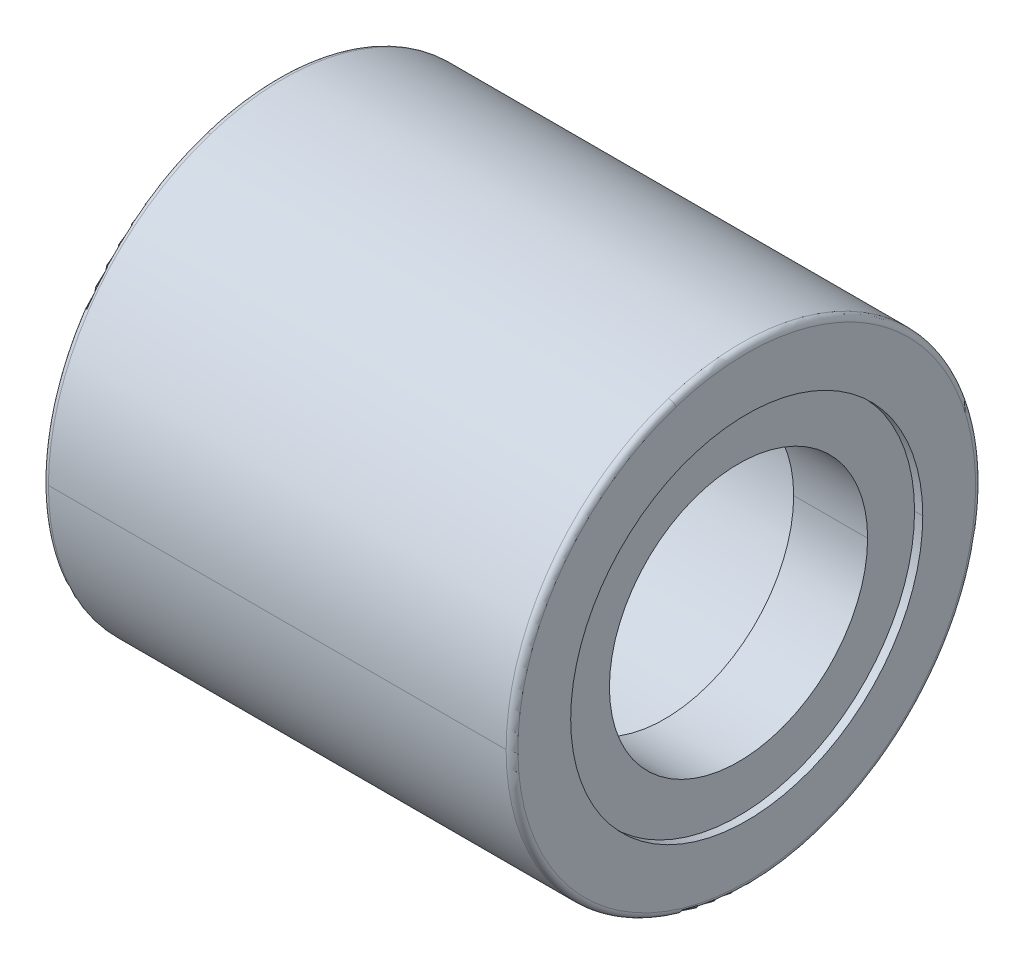
ISO-10303-21;
HEADER;
FILE_DESCRIPTION(('STEP AP214'),'2;1');
FILE_NAME('part.step','',(''),(''),'','','');
FILE_SCHEMA(('AUTOMOTIVE_DESIGN { 1 0 10303 214 1 1 1 1 }'));
ENDSEC;
DATA;
#1=APPLICATION_CONTEXT('core data for automotive mechanical design processes');
#2=APPLICATION_PROTOCOL_DEFINITION('international standard','automotive_design',2000,#1);
#3=PRODUCT_CONTEXT('',#1,'mechanical');
#4=PRODUCT('Part','Part','',(#3));
#5=PRODUCT_RELATED_PRODUCT_CATEGORY('part','',(#4));
#6=PRODUCT_DEFINITION_FORMATION('','',#4);
#7=PRODUCT_DEFINITION_CONTEXT('part definition',#1,'design');
#8=PRODUCT_DEFINITION('design','',#6,#7);
#9=PRODUCT_DEFINITION_SHAPE('','',#8);
#10=(LENGTH_UNIT() NAMED_UNIT(*) SI_UNIT(.MILLI.,.METRE.));
#11=(NAMED_UNIT(*) PLANE_ANGLE_UNIT() SI_UNIT($,.RADIAN.));
#12=(NAMED_UNIT(*) SI_UNIT($,.STERADIAN.) SOLID_ANGLE_UNIT());
#13=UNCERTAINTY_MEASURE_WITH_UNIT(LENGTH_MEASURE(1.E-05),#10,'distance_accuracy_value','');
#14=(GEOMETRIC_REPRESENTATION_CONTEXT(3) GLOBAL_UNCERTAINTY_ASSIGNED_CONTEXT((#13)) GLOBAL_UNIT_ASSIGNED_CONTEXT((#10,
#11,#12)) REPRESENTATION_CONTEXT('',''));
#15=CARTESIAN_POINT('',(0.,0.,0.));
#16=DIRECTION('',(0.,0.,1.));
#17=DIRECTION('',(1.,0.,0.));
#18=AXIS2_PLACEMENT_3D('',#15,#16,#17);
#19=CARTESIAN_POINT('',(50.,0.,0.));
#20=DIRECTION('',(1.,0.,0.));
#21=DIRECTION('',(0.,1.,0.));
#22=AXIS2_PLACEMENT_3D('',#19,#20,#21);
#23=CYLINDRICAL_SURFACE('',#22,4.5);
#24=DIRECTION('',(1.,0.,0.));
#25=VECTOR('',#24,1.);
#26=CARTESIAN_POINT('',(2.1,0.,4.5));
#27=LINE('',#26,#25);
#28=CARTESIAN_POINT('',(2.1,0.,4.5));
#29=VERTEX_POINT('',#28);
#30=CARTESIAN_POINT('',(9.9,0.,4.5));
#31=VERTEX_POINT('',#30);
#32=EDGE_CURVE('E10',#29,#31,#27,.T.);
#33=ORIENTED_EDGE('',*,*,#32,.T.);
#34=CARTESIAN_POINT('',(9.9,0.,0.));
#35=DIRECTION('',(1.,0.,0.));
#36=DIRECTION('',(0.,0.,-1.));
#37=AXIS2_PLACEMENT_3D('',#34,#35,#36);
#38=CIRCLE('',#37,4.5);
#39=CARTESIAN_POINT('',(9.9,0.,-4.5));
#40=VERTEX_POINT('',#39);
#41=EDGE_CURVE('E24',#31,#40,#38,.T.);
#42=ORIENTED_EDGE('',*,*,#41,.T.);
#43=DIRECTION('',(1.,0.,0.));
#44=VECTOR('',#43,1.);
#45=CARTESIAN_POINT('',(2.1,0.,-4.5));
#46=LINE('',#45,#44);
#47=CARTESIAN_POINT('',(2.1,0.,-4.5));
#48=VERTEX_POINT('',#47);
#49=EDGE_CURVE('E432',#48,#40,#46,.T.);
#50=ORIENTED_EDGE('',*,*,#49,.F.);
#51=CARTESIAN_POINT('',(2.1,0.,0.));
#52=DIRECTION('',(1.,0.,0.));
#53=DIRECTION('',(0.,0.,-1.));
#54=AXIS2_PLACEMENT_3D('',#51,#52,#53);
#55=CIRCLE('',#54,4.5);
#56=EDGE_CURVE('E427',#29,#48,#55,.T.);
#57=ORIENTED_EDGE('',*,*,#56,.F.);
#58=EDGE_LOOP('',(#33,#42,#50,#57));
#59=FACE_BOUND('',#58,.T.);
#60=ADVANCED_FACE('F16',(#59),#23,.F.);
#61=CARTESIAN_POINT('',(2.1,3.3,0.));
#62=DIRECTION('',(1.,0.,0.));
#63=DIRECTION('',(0.,0.,-1.));
#64=AXIS2_PLACEMENT_3D('',#61,#62,#63);
#65=PLANE('',#64);
#66=CARTESIAN_POINT('',(2.1,0.,0.));
#67=DIRECTION('',(1.,0.,0.));
#68=DIRECTION('',(0.,0.,-1.));
#69=AXIS2_PLACEMENT_3D('',#66,#67,#68);
#70=CIRCLE('',#69,4.5);
#71=EDGE_CURVE('E422',#48,#29,#70,.T.);
#72=ORIENTED_EDGE('',*,*,#71,.T.);
#73=ORIENTED_EDGE('',*,*,#56,.T.);
#74=EDGE_LOOP('',(#72,#73));
#75=FACE_BOUND('',#74,.T.);
#76=CARTESIAN_POINT('',(2.1,0.,0.));
#77=DIRECTION('',(1.,0.,0.));
#78=DIRECTION('',(0.,0.,-1.));
#79=AXIS2_PLACEMENT_3D('',#76,#77,#78);
#80=CIRCLE('',#79,3.3);
#81=CARTESIAN_POINT('',(2.1,0.,3.3));
#82=VERTEX_POINT('',#81);
#83=CARTESIAN_POINT('',(2.1,0.,-3.3));
#84=VERTEX_POINT('',#83);
#85=EDGE_CURVE('E417',#82,#84,#80,.T.);
#86=ORIENTED_EDGE('',*,*,#85,.F.);
#87=CARTESIAN_POINT('',(2.1,0.,0.));
#88=DIRECTION('',(1.,0.,0.));
#89=DIRECTION('',(0.,0.,-1.));
#90=AXIS2_PLACEMENT_3D('',#87,#88,#89);
#91=CIRCLE('',#90,3.3);
#92=EDGE_CURVE('E412',#84,#82,#91,.T.);
#93=ORIENTED_EDGE('',*,*,#92,.F.);
#94=EDGE_LOOP('',(#86,#93));
#95=FACE_BOUND('',#94,.T.);
#96=ADVANCED_FACE('F445',(#75,#95),#65,.T.);
#97=CARTESIAN_POINT('',(50.,0.,0.));
#98=DIRECTION('',(1.,0.,0.));
#99=DIRECTION('',(0.,-1.,0.));
#100=AXIS2_PLACEMENT_3D('',#97,#98,#99);
#101=CYLINDRICAL_SURFACE('',#100,3.3);
#102=DIRECTION('',(1.,0.,0.));
#103=VECTOR('',#102,1.);
#104=CARTESIAN_POINT('',(0.210000000000001,0.,3.3));
#105=LINE('',#104,#103);
#106=CARTESIAN_POINT('',(0.210000000000001,0.,3.3));
#107=VERTEX_POINT('',#106);
#108=EDGE_CURVE('E407',#107,#82,#105,.T.);
#109=ORIENTED_EDGE('',*,*,#108,.F.);
#110=CARTESIAN_POINT('',(0.21,0.,0.));
#111=DIRECTION('',(1.,0.,0.));
#112=DIRECTION('',(0.,0.,-1.));
#113=AXIS2_PLACEMENT_3D('',#110,#111,#112);
#114=CIRCLE('',#113,3.3);
#115=CARTESIAN_POINT('',(0.21,0.,-3.3));
#116=VERTEX_POINT('',#115);
#117=EDGE_CURVE('E402',#116,#107,#114,.T.);
#118=ORIENTED_EDGE('',*,*,#117,.F.);
#119=DIRECTION('',(1.,0.,0.));
#120=VECTOR('',#119,1.);
#121=CARTESIAN_POINT('',(0.210000000000001,0.,-3.3));
#122=LINE('',#121,#120);
#123=EDGE_CURVE('E397',#116,#84,#122,.T.);
#124=ORIENTED_EDGE('',*,*,#123,.T.);
#125=ORIENTED_EDGE('',*,*,#92,.T.);
#126=EDGE_LOOP('',(#109,#118,#124,#125));
#127=FACE_BOUND('',#126,.T.);
#128=ADVANCED_FACE('F448',(#127),#101,.F.);
#129=CARTESIAN_POINT('',(50.,0.,0.));
#130=DIRECTION('',(1.,0.,0.));
#131=DIRECTION('',(0.,1.,0.));
#132=AXIS2_PLACEMENT_3D('',#129,#130,#131);
#133=CYLINDRICAL_SURFACE('',#132,3.3);
#134=ORIENTED_EDGE('',*,*,#108,.T.);
#135=ORIENTED_EDGE('',*,*,#85,.T.);
#136=ORIENTED_EDGE('',*,*,#123,.F.);
#137=CARTESIAN_POINT('',(0.21,0.,0.));
#138=DIRECTION('',(1.,0.,0.));
#139=DIRECTION('',(0.,0.,-1.));
#140=AXIS2_PLACEMENT_3D('',#137,#138,#139);
#141=CIRCLE('',#140,3.3);
#142=EDGE_CURVE('E392',#107,#116,#141,.T.);
#143=ORIENTED_EDGE('',*,*,#142,.F.);
#144=EDGE_LOOP('',(#134,#135,#136,#143));
#145=FACE_BOUND('',#144,.T.);
#146=ADVANCED_FACE('F452',(#145),#133,.F.);
#147=CARTESIAN_POINT('',(0.21,4.5,0.));
#148=DIRECTION('',(-1.,0.,0.));
#149=DIRECTION('',(0.,0.,1.));
#150=AXIS2_PLACEMENT_3D('',#147,#148,#149);
#151=PLANE('',#150);
#152=ORIENTED_EDGE('',*,*,#117,.T.);
#153=ORIENTED_EDGE('',*,*,#142,.T.);
#154=EDGE_LOOP('',(#152,#153));
#155=FACE_BOUND('',#154,.T.);
#156=CARTESIAN_POINT('',(0.21,0.,0.));
#157=DIRECTION('',(1.,0.,0.));
#158=DIRECTION('',(0.,0.,-1.));
#159=AXIS2_PLACEMENT_3D('',#156,#157,#158);
#160=CIRCLE('',#159,4.5);
#161=CARTESIAN_POINT('',(0.210000000000001,0.,4.5));
#162=VERTEX_POINT('',#161);
#163=CARTESIAN_POINT('',(0.21,0.,-4.5));
#164=VERTEX_POINT('',#163);
#165=EDGE_CURVE('E387',#162,#164,#160,.T.);
#166=ORIENTED_EDGE('',*,*,#165,.F.);
#167=CARTESIAN_POINT('',(0.21,0.,0.));
#168=DIRECTION('',(1.,0.,0.));
#169=DIRECTION('',(0.,0.,-1.));
#170=AXIS2_PLACEMENT_3D('',#167,#168,#169);
#171=CIRCLE('',#170,4.5);
#172=EDGE_CURVE('E382',#164,#162,#171,.T.);
#173=ORIENTED_EDGE('',*,*,#172,.F.);
#174=EDGE_LOOP('',(#166,#173));
#175=FACE_BOUND('',#174,.T.);
#176=ADVANCED_FACE('F455',(#155,#175),#151,.T.);
#177=CARTESIAN_POINT('',(50.,0.,0.));
#178=DIRECTION('',(1.,0.,0.));
#179=DIRECTION('',(0.,-1.,0.));
#180=AXIS2_PLACEMENT_3D('',#177,#178,#179);
#181=CYLINDRICAL_SURFACE('',#180,4.5);
#182=DIRECTION('',(1.,0.,0.));
#183=VECTOR('',#182,1.);
#184=CARTESIAN_POINT('',(0.,0.,4.5));
#185=LINE('',#184,#183);
#186=CARTESIAN_POINT('',(0.,0.,4.5));
#187=VERTEX_POINT('',#186);
#188=EDGE_CURVE('E377',#187,#162,#185,.T.);
#189=ORIENTED_EDGE('',*,*,#188,.F.);
#190=CARTESIAN_POINT('',(0.,0.,0.));
#191=DIRECTION('',(1.,0.,0.));
#192=DIRECTION('',(0.,0.,-1.));
#193=AXIS2_PLACEMENT_3D('',#190,#191,#192);
#194=CIRCLE('',#193,4.5);
#195=CARTESIAN_POINT('',(0.,0.,-4.5));
#196=VERTEX_POINT('',#195);
#197=EDGE_CURVE('E372',#196,#187,#194,.T.);
#198=ORIENTED_EDGE('',*,*,#197,.F.);
#199=DIRECTION('',(1.,0.,0.));
#200=VECTOR('',#199,1.);
#201=CARTESIAN_POINT('',(0.,0.,-4.5));
#202=LINE('',#201,#200);
#203=EDGE_CURVE('E367',#196,#164,#202,.T.);
#204=ORIENTED_EDGE('',*,*,#203,.T.);
#205=ORIENTED_EDGE('',*,*,#172,.T.);
#206=EDGE_LOOP('',(#189,#198,#204,#205));
#207=FACE_BOUND('',#206,.T.);
#208=ADVANCED_FACE('F458',(#207),#181,.F.);
#209=CARTESIAN_POINT('',(50.,0.,0.));
#210=DIRECTION('',(1.,0.,0.));
#211=DIRECTION('',(0.,1.,0.));
#212=AXIS2_PLACEMENT_3D('',#209,#210,#211);
#213=CYLINDRICAL_SURFACE('',#212,4.5);
#214=ORIENTED_EDGE('',*,*,#188,.T.);
#215=ORIENTED_EDGE('',*,*,#165,.T.);
#216=ORIENTED_EDGE('',*,*,#203,.F.);
#217=CARTESIAN_POINT('',(0.,0.,0.));
#218=DIRECTION('',(1.,0.,0.));
#219=DIRECTION('',(0.,0.,-1.));
#220=AXIS2_PLACEMENT_3D('',#217,#218,#219);
#221=CIRCLE('',#220,4.5);
#222=EDGE_CURVE('E364',#187,#196,#221,.T.);
#223=ORIENTED_EDGE('',*,*,#222,.F.);
#224=EDGE_LOOP('',(#214,#215,#216,#223));
#225=FACE_BOUND('',#224,.T.);
#226=ADVANCED_FACE('F463',(#225),#213,.F.);
#227=CARTESIAN_POINT('',(0.,5.85,0.));
#228=DIRECTION('',(-1.,0.,0.));
#229=DIRECTION('',(0.,0.,1.));
#230=AXIS2_PLACEMENT_3D('',#227,#228,#229);
#231=PLANE('',#230);
#232=ORIENTED_EDGE('',*,*,#197,.T.);
#233=ORIENTED_EDGE('',*,*,#222,.T.);
#234=EDGE_LOOP('',(#232,#233));
#235=FACE_BOUND('',#234,.T.);
#236=CARTESIAN_POINT('',(0.,-5.56368062032664,-1.80774941709346));
#237=CARTESIAN_POINT('',(0.,-5.53410329087941,-1.89878564774362));
#238=CARTESIAN_POINT('',(0.,-5.50228787378155,-1.98909449796987));
#239=CARTESIAN_POINT('',(0.,-5.43426585360946,-2.16804304701102));
#240=CARTESIAN_POINT('',(0.,-5.39805925053523,-2.25668274582593));
#241=CARTESIAN_POINT('',(0.,-5.32133984773525,-2.43207860148085));
#242=CARTESIAN_POINT('',(0.,-5.28082704800951,-2.51883475832087));
#243=CARTESIAN_POINT('',(0.,-5.19559344980424,-2.69025475453914));
#244=CARTESIAN_POINT('',(0.,-5.15087265132471,-2.77491859391739));
#245=CARTESIAN_POINT('',(0.,-5.057330631427,-2.941949931597));
#246=CARTESIAN_POINT('',(0.,-5.00850941000881,-3.02431742989836));
#247=CARTESIAN_POINT('',(0.,-4.90688420183972,-3.18655767125392));
#248=CARTESIAN_POINT('',(0.,-4.85408021508882,-3.26643041430812));
#249=CARTESIAN_POINT('',(0.,-4.74461667415968,-3.42348872035496));
#250=CARTESIAN_POINT('',(0.,-4.68795711998145,-3.50067428334761));
#251=CARTESIAN_POINT('',(0.,-4.57091894511426,-3.65217228366316));
#252=CARTESIAN_POINT('',(0.,-4.5105403244253,-3.72648472098606));
#253=CARTESIAN_POINT('',(0.,-4.38620947309505,-3.87205744447711));
#254=CARTESIAN_POINT('',(0.,-4.32225724245377,-3.94331773064525));
#255=CARTESIAN_POINT('',(0.,-4.19093323796574,-4.08261447964002));
#256=CARTESIAN_POINT('',(0.,-4.123561464119,-4.15065094246664));
#257=CARTESIAN_POINT('',(0.,-3.98556067766492,-4.28333613895753));
#258=CARTESIAN_POINT('',(0.,-3.91493166505759,-4.3479848726218));
#259=CARTESIAN_POINT('',(0.,-3.77058655257598,-4.47373886633209));
#260=CARTESIAN_POINT('',(0.,-3.69687045270171,-4.5348441263781));
#261=CARTESIAN_POINT('',(0.,-3.54652875422333,-4.65336396492662));
#262=CARTESIAN_POINT('',(0.,-3.46990315561923,-4.71077854342912));
#263=CARTESIAN_POINT('',(0.,-3.31392705746097,-4.82177870214251));
#264=CARTESIAN_POINT('',(0.,-3.23457655790682,-4.8753642823534));
#265=CARTESIAN_POINT('',(0.,-3.07334182015187,-4.97857735212716));
#266=CARTESIAN_POINT('',(0.,-2.99145758195108,-5.02820484169005));
#267=CARTESIAN_POINT('',(0.,-2.82535263320497,-5.12338217319863));
#268=CARTESIAN_POINT('',(0.,-2.74113192265965,-5.16893201514432));
#269=CARTESIAN_POINT('',(0.,-2.57055692429304,-5.25584431785959));
#270=CARTESIAN_POINT('',(0.,-2.48420263647174,-5.29720677862915));
#271=CARTESIAN_POINT('',(0.,-2.30956851859628,-5.37564467320123));
#272=CARTESIAN_POINT('',(0.,-2.22128868854212,-5.41272010700374));
#273=CARTESIAN_POINT('',(0.,-2.04301616004392,-5.48249462967426));
#274=CARTESIAN_POINT('',(0.,-1.95302346159989,-5.51519371854227));
#275=CARTESIAN_POINT('',(0.,-1.77154199661493,-5.5761367763746));
#276=CARTESIAN_POINT('',(0.,-1.68005323007401,-5.60438074533892));
#277=CARTESIAN_POINT('',(0.,-1.49580003334735,-5.65634552116876));
#278=CARTESIAN_POINT('',(0.,-1.4030356031616,-5.68006632803427));
#279=CARTESIAN_POINT('',(0.,-1.21645455678282,-5.72292763416506));
#280=CARTESIAN_POINT('',(0.,-1.12263794058978,-5.74206813343033));
#281=CARTESIAN_POINT('',(0.,-0.934178534642165,-5.7757227132214));
#282=CARTESIAN_POINT('',(0.,-0.839535744887597,-5.79023679374719));
#283=CARTESIAN_POINT('',(0.,-0.649651994587183,-5.81460357036803));
#284=CARTESIAN_POINT('',(0.,-0.554411034041337,-5.82445626646307));
#285=CARTESIAN_POINT('',(0.,-0.363560385974445,-5.83947653821452));
#286=CARTESIAN_POINT('',(0.,-0.267950698453397,-5.84464411387093));
#287=CARTESIAN_POINT('',(0.,-0.0765929285477637,-5.85028169560272));
#288=CARTESIAN_POINT('',(0.,0.0191551538368229,-5.8507517016781));
#289=CARTESIAN_POINT('',(0.,0.210559047952533,-5.84699301196205));
#290=CARTESIAN_POINT('',(0.,0.306214859683656,-5.84276431617062));
#291=CARTESIAN_POINT('',(0.,0.497203769263518,-5.82961841001947));
#292=CARTESIAN_POINT('',(0.,0.592536867112258,-5.82070119965976));
#293=CARTESIAN_POINT('',(0.,0.782650683144442,-5.79819974671288));
#294=CARTESIAN_POINT('',(0.,0.877431401327887,-5.78461550412571));
#295=CARTESIAN_POINT('',(0.,1.06621212297757,-5.75281271235414));
#296=CARTESIAN_POINT('',(0.,1.1602121264438,-5.73459416316974));
#297=CARTESIAN_POINT('',(0.,1.34720496441729,-5.69356664828446));
#298=CARTESIAN_POINT('',(0.,1.44019779892454,-5.67075768258358));
#299=CARTESIAN_POINT('',(0.,1.62495227109651,-5.62060428346153));
#300=CARTESIAN_POINT('',(0.,1.71671390876123,-5.59325985004036));
#301=CARTESIAN_POINT('',(0.,1.89878492542565,-5.53410139061294));
#302=CARTESIAN_POINT('',(0.,1.98909430442534,-5.50228736460669));
#303=CARTESIAN_POINT('',(0.,2.16804324055552,-5.43426636278433));
#304=CARTESIAN_POINT('',(0.,2.25668279768601,-5.39805938696823));
#305=CARTESIAN_POINT('',(0.,2.43207854962074,-5.32133971130226));
#306=CARTESIAN_POINT('',(0.,2.51883474442498,-5.2808270114524));
#307=CARTESIAN_POINT('',(0.,2.690254768435,-5.19559348636135));
#308=CARTESIAN_POINT('',(0.,2.77491859764077,-5.15087266112017));
#309=CARTESIAN_POINT('',(0.,2.9419499278736,-5.05733062163156));
#310=CARTESIAN_POINT('',(0.,3.02431742890067,-5.00850940738414));
#311=CARTESIAN_POINT('',(0.,3.18655767225158,-4.90688420446441));
#312=CARTESIAN_POINT('',(0.,3.26643041457543,-4.85408021579211));
#313=CARTESIAN_POINT('',(0.,3.42348872008762,-4.74461667345641));
#314=CARTESIAN_POINT('',(0.,3.50067428327597,-4.68795711979302));
#315=CARTESIAN_POINT('',(0.,3.65217228373478,-4.57091894530271));
#316=CARTESIAN_POINT('',(0.,3.72648472100524,-4.5105403244758));
#317=CARTESIAN_POINT('',(0.,3.8720574444579,-4.38620947304457));
#318=CARTESIAN_POINT('',(0.,3.9433177306401,-4.32225724244025));
#319=CARTESIAN_POINT('',(0.,4.08261447964515,-4.19093323797928));
#320=CARTESIAN_POINT('',(0.,4.150650942468,-4.12356146412264));
#321=CARTESIAN_POINT('',(0.,4.28333613895614,-3.98556067766131));
#322=CARTESIAN_POINT('',(0.,4.34798487262142,-3.91493166505663));
#323=CARTESIAN_POINT('',(0.,4.47373886633245,-3.77058655257697));
#324=CARTESIAN_POINT('',(0.,4.53484412637819,-3.69687045270198));
#325=CARTESIAN_POINT('',(0.,4.65336396492652,-3.54652875422309));
#326=CARTESIAN_POINT('',(0.,4.71077854342909,-3.46990315561917));
#327=CARTESIAN_POINT('',(0.,4.82177870214253,-3.31392705746105));
#328=CARTESIAN_POINT('',(0.,4.8753642823534,-3.23457655790685));
#329=CARTESIAN_POINT('',(0.,4.97857735212715,-3.07334182015187));
#330=CARTESIAN_POINT('',(0.,5.02820484169003,-2.99145758195109));
#331=CARTESIAN_POINT('',(0.,5.12338217319862,-2.82535263320499));
#332=CARTESIAN_POINT('',(0.,5.16893201514432,-2.74113192265967));
#333=CARTESIAN_POINT('',(0.,5.25584431785958,-2.57055692429305));
#334=CARTESIAN_POINT('',(0.,5.29720677862914,-2.48420263647176));
#335=CARTESIAN_POINT('',(0.,5.37564467320123,-2.30956851859629));
#336=CARTESIAN_POINT('',(0.,5.41272010700376,-2.22128868854213));
#337=CARTESIAN_POINT('',(0.,5.48249462967424,-2.04301616004394));
#338=CARTESIAN_POINT('',(0.,5.5151937185422,-1.95302346159992));
#339=CARTESIAN_POINT('',(0.,5.57613677637467,-1.77154199661493));
#340=CARTESIAN_POINT('',(0.,5.60438074533919,-1.68005323007395));
#341=CARTESIAN_POINT('',(0.,5.65634552116848,-1.49580003334744));
#342=CARTESIAN_POINT('',(0.,5.68006632803326,-1.40303560316189));
#343=CARTESIAN_POINT('',(0.,5.72292763416606,-1.21645455678256));
#344=CARTESIAN_POINT('',(0.,5.74206813343407,-1.12263794058878));
#345=CARTESIAN_POINT('',(0.,5.77572271321765,-0.934178534643197));
#346=CARTESIAN_POINT('',(0.,5.79023679373322,-0.839535744891405));
#347=CARTESIAN_POINT('',(0.,5.814603570382,-0.649651994583407));
#348=CARTESIAN_POINT('',(0.,5.8244562665152,-0.554411034027202));
#349=CARTESIAN_POINT('',(0.,5.83947653816239,-0.363560385988614));
#350=CARTESIAN_POINT('',(0.,5.84464411367637,-0.267950698506231));
#351=CARTESIAN_POINT('',(0.,5.85028169579728,-0.0765929284949695));
#352=CARTESIAN_POINT('',(0.,5.8507517024042,0.0191551540339095));
#353=CARTESIAN_POINT('',(0.,5.84699301123596,0.210559047755407));
#354=CARTESIAN_POINT('',(0.,5.84276431346078,0.306214858948027));
#355=CARTESIAN_POINT('',(0.,5.8296184127293,0.497203769999113));
#356=CARTESIAN_POINT('',(0.,5.820701209773,0.592536869857579));
#357=CARTESIAN_POINT('',(0.,5.79819973659965,0.782650680399092));
#358=CARTESIAN_POINT('',(0.,5.7846154663826,0.877431391082139));
#359=CARTESIAN_POINT('',(0.,5.75281275009726,1.06621213322329));
#360=CARTESIAN_POINT('',(0.,5.73459430402896,1.16021216468139));
#361=CARTESIAN_POINT('',(0.,5.69356650742526,1.34720492617967));
#362=CARTESIAN_POINT('',(0.,5.67075715688985,1.44019765621984));
#363=CARTESIAN_POINT('',(0.,5.62060480915526,1.62495241380117));
#364=CARTESIAN_POINT('',(0.,5.59326181195607,1.71671444134233));
#365=CARTESIAN_POINT('',(0.,5.56368062032665,1.80774941709343));
#366=B_SPLINE_CURVE_WITH_KNOTS('',3,(#236,#237,#238,#239,#240,#241,#242,#243,#244,#245,#246,
#247,#248,#249,#250,#251,#252,#253,#254,#255,#256,#257,#258,#259,#260,#261,#262,#263,#264,#265,
#266,#267,#268,#269,#270,#271,#272,#273,#274,#275,#276,#277,#278,#279,#280,#281,#282,#283,#284,
#285,#286,#287,#288,#289,#290,#291,#292,#293,#294,#295,#296,#297,#298,#299,#300,#301,#302,#303,
#304,#305,#306,#307,#308,#309,#310,#311,#312,#313,#314,#315,#316,#317,#318,#319,#320,#321,#322,
#323,#324,#325,#326,#327,#328,#329,#330,#331,#332,#333,#334,#335,#336,#337,#338,#339,#340,#341,
#342,#343,#344,#345,#346,#347,#348,#349,#350,#351,#352,#353,#354,#355,#356,#357,#358,#359,#360,
#361,#362,#363,#364,#365),.UNSPECIFIED.,.F.,.F.,(4,2,2,2,2,2,2,2,2,2,2,2,2,2,2,2,2,2,2,2,2,2,2,
2,2,2,2,2,2,2,2,2,2,2,2,2,2,2,2,2,2,2,2,2,2,2,2,2,2,2,2,2,2,2,2,2,2,2,2,2,2,2,2,2,4),(0.,
0.287132373718072,0.574264747436147,0.861397121154219,1.14852949487229,1.43566186859037,
1.72279424230844,2.00992661602651,2.29705898974459,2.58419136346266,2.87132373718073,
3.15845611089881,3.44558848461688,3.73272085833495,4.01985323205302,4.3069856057711,
4.59411797948917,4.88125035320724,5.16838272692532,5.45551510064339,5.74264747436147,
6.02977984807954,6.31691222179761,6.60404459551568,6.89117696923376,7.17830934295183,
7.4654417166699,7.75257409038798,8.03970646410605,8.32683883782412,8.6139712115422,
8.90110358526027,9.18823595897834,9.47536833269642,9.76250070641449,10.0496330801326,
10.3367654538506,10.6238978275687,10.9110302012868,11.1981625750049,11.4852949487229,
11.772427322441,12.0595596961591,12.3466920698771,12.6338244435952,12.9209568173133,
13.2080891910314,13.4952215647494,13.7823539384675,14.0694863121856,14.3566186859037,
14.6437510596217,14.9308834333398,15.2180158070579,15.505148180776,15.792280554494,
16.0794129282121,16.3665453019302,16.6536776756482,16.9408100493663,17.2279424230844,
17.5150747968025,17.8022071705205,18.0893395442386,18.3764719179567),.UNSPECIFIED.);
#367=CARTESIAN_POINT('',(0.,-5.56368062032665,-1.80774941709344));
#368=VERTEX_POINT('',#367);
#369=CARTESIAN_POINT('',(0.,5.56368062032665,1.80774941709344));
#370=VERTEX_POINT('',#369);
#371=EDGE_CURVE('E363',#368,#370,#366,.T.);
#372=ORIENTED_EDGE('',*,*,#371,.F.);
#373=CARTESIAN_POINT('',(0.,5.56368062032664,1.80774941709346));
#374=CARTESIAN_POINT('',(0.,5.53410329087941,1.89878564774362));
#375=CARTESIAN_POINT('',(0.,5.50228787378155,1.98909449796987));
#376=CARTESIAN_POINT('',(0.,5.43426585360946,2.16804304701102));
#377=CARTESIAN_POINT('',(0.,5.39805925053523,2.25668274582593));
#378=CARTESIAN_POINT('',(0.,5.32133984773525,2.43207860148085));
#379=CARTESIAN_POINT('',(0.,5.28082704800951,2.51883475832087));
#380=CARTESIAN_POINT('',(0.,5.19559344980424,2.69025475453914));
#381=CARTESIAN_POINT('',(0.,5.15087265132471,2.77491859391739));
#382=CARTESIAN_POINT('',(0.,5.057330631427,2.94194993159701));
#383=CARTESIAN_POINT('',(0.,5.00850941000881,3.02431742989836));
#384=CARTESIAN_POINT('',(0.,4.90688420183972,3.18655767125392));
#385=CARTESIAN_POINT('',(0.,4.85408021508881,3.26643041430812));
#386=CARTESIAN_POINT('',(0.,4.74461667415968,3.42348872035497));
#387=CARTESIAN_POINT('',(0.,4.68795711998145,3.50067428334761));
#388=CARTESIAN_POINT('',(0.,4.57091894511426,3.65217228366316));
#389=CARTESIAN_POINT('',(0.,4.51054032442529,3.72648472098606));
#390=CARTESIAN_POINT('',(0.,4.38620947309505,3.87205744447711));
#391=CARTESIAN_POINT('',(0.,4.32225724245377,3.94331773064526));
#392=CARTESIAN_POINT('',(0.,4.19093323796574,4.08261447964002));
#393=CARTESIAN_POINT('',(0.,4.123561464119,4.15065094246664));
#394=CARTESIAN_POINT('',(0.,3.98556067766492,4.28333613895753));
#395=CARTESIAN_POINT('',(0.,3.91493166505759,4.3479848726218));
#396=CARTESIAN_POINT('',(0.,3.77058655257598,4.47373886633209));
#397=CARTESIAN_POINT('',(0.,3.69687045270171,4.53484412637811));
#398=CARTESIAN_POINT('',(0.,3.54652875422333,4.65336396492663));
#399=CARTESIAN_POINT('',(0.,3.46990315561922,4.71077854342913));
#400=CARTESIAN_POINT('',(0.,3.31392705746097,4.82177870214251));
#401=CARTESIAN_POINT('',(0.,3.23457655790681,4.8753642823534));
#402=CARTESIAN_POINT('',(0.,3.07334182015187,4.97857735212717));
#403=CARTESIAN_POINT('',(0.,2.99145758195107,5.02820484169005));
#404=CARTESIAN_POINT('',(0.,2.82535263320496,5.12338217319863));
#405=CARTESIAN_POINT('',(0.,2.74113192265964,5.16893201514433));
#406=CARTESIAN_POINT('',(0.,2.57055692429303,5.25584431785959));
#407=CARTESIAN_POINT('',(0.,2.48420263647174,5.29720677862915));
#408=CARTESIAN_POINT('',(0.,2.30956851859628,5.37564467320123));
#409=CARTESIAN_POINT('',(0.,2.22128868854211,5.41272010700374));
#410=CARTESIAN_POINT('',(0.,2.04301616004392,5.48249462967427));
#411=CARTESIAN_POINT('',(0.,1.95302346159988,5.51519371854228));
#412=CARTESIAN_POINT('',(0.,1.77154199661493,5.5761367763746));
#413=CARTESIAN_POINT('',(0.,1.68005323007401,5.60438074533892));
#414=CARTESIAN_POINT('',(0.,1.49580003334734,5.65634552116876));
#415=CARTESIAN_POINT('',(0.,1.4030356031616,5.68006632803427));
#416=CARTESIAN_POINT('',(0.,1.21645455678281,5.72292763416506));
#417=CARTESIAN_POINT('',(0.,1.12263794058977,5.74206813343033));
#418=CARTESIAN_POINT('',(0.,0.934178534642157,5.7757227132214));
#419=CARTESIAN_POINT('',(0.,0.839535744887589,5.7902367937472));
#420=CARTESIAN_POINT('',(0.,0.649651994587175,5.81460357036803));
#421=CARTESIAN_POINT('',(0.,0.554411034041329,5.82445626646308));
#422=CARTESIAN_POINT('',(0.,0.363560385974437,5.83947653821452));
#423=CARTESIAN_POINT('',(0.,0.267950698453391,5.84464411387093));
#424=CARTESIAN_POINT('',(0.,0.076592928547757,5.85028169560272));
#425=CARTESIAN_POINT('',(0.,-0.0191551538368305,5.85075170167811));
#426=CARTESIAN_POINT('',(0.,-0.210559047952541,5.84699301196205));
#427=CARTESIAN_POINT('',(0.,-0.306214859683664,5.84276431617062));
#428=CARTESIAN_POINT('',(0.,-0.497203769263528,5.82961841001947));
#429=CARTESIAN_POINT('',(0.,-0.592536867112268,5.82070119965976));
#430=CARTESIAN_POINT('',(0.,-0.782650683144453,5.79819974671288));
#431=CARTESIAN_POINT('',(0.,-0.877431401327897,5.78461550412571));
#432=CARTESIAN_POINT('',(0.,-1.06621212297758,5.75281271235414));
#433=CARTESIAN_POINT('',(0.,-1.16021212644381,5.73459416316974));
#434=CARTESIAN_POINT('',(0.,-1.3472049644173,5.69356664828446));
#435=CARTESIAN_POINT('',(0.,-1.44019779892455,5.67075768258358));
#436=CARTESIAN_POINT('',(0.,-1.62495227109652,5.62060428346152));
#437=CARTESIAN_POINT('',(0.,-1.71671390876124,5.59325985004036));
#438=CARTESIAN_POINT('',(0.,-1.89878492542566,5.53410139061294));
#439=CARTESIAN_POINT('',(0.,-1.98909430442535,5.50228736460669));
#440=CARTESIAN_POINT('',(0.,-2.16804324055553,5.43426636278433));
#441=CARTESIAN_POINT('',(0.,-2.25668279768602,5.39805938696823));
#442=CARTESIAN_POINT('',(0.,-2.43207854962075,5.32133971130226));
#443=CARTESIAN_POINT('',(0.,-2.51883474442499,5.2808270114524));
#444=CARTESIAN_POINT('',(0.,-2.690254768435,5.19559348636135));
#445=CARTESIAN_POINT('',(0.,-2.77491859764078,5.15087266112016));
#446=CARTESIAN_POINT('',(0.,-2.94194992787361,5.05733062163155));
#447=CARTESIAN_POINT('',(0.,-3.02431742890068,5.00850940738413));
#448=CARTESIAN_POINT('',(0.,-3.1865576722516,4.9068842044644));
#449=CARTESIAN_POINT('',(0.,-3.26643041457544,4.8540802157921));
#450=CARTESIAN_POINT('',(0.,-3.42348872008763,4.7446166734564));
#451=CARTESIAN_POINT('',(0.,-3.50067428327598,4.68795711979301));
#452=CARTESIAN_POINT('',(0.,-3.65217228373479,4.57091894530271));
#453=CARTESIAN_POINT('',(0.,-3.72648472100525,4.51054032447579));
#454=CARTESIAN_POINT('',(0.,-3.87205744445791,4.38620947304456));
#455=CARTESIAN_POINT('',(0.,-3.94331773064011,4.32225724244024));
#456=CARTESIAN_POINT('',(0.,-4.08261447964516,4.19093323797928));
#457=CARTESIAN_POINT('',(0.,-4.15065094246801,4.12356146412263));
#458=CARTESIAN_POINT('',(0.,-4.28333613895615,3.9855606776613));
#459=CARTESIAN_POINT('',(0.,-4.34798487262143,3.91493166505662));
#460=CARTESIAN_POINT('',(0.,-4.47373886633246,3.77058655257695));
#461=CARTESIAN_POINT('',(0.,-4.5348441263782,3.69687045270197));
#462=CARTESIAN_POINT('',(0.,-4.65336396492652,3.54652875422307));
#463=CARTESIAN_POINT('',(0.,-4.7107785434291,3.46990315561916));
#464=CARTESIAN_POINT('',(0.,-4.82177870214254,3.31392705746104));
#465=CARTESIAN_POINT('',(0.,-4.8753642823534,3.23457655790684));
#466=CARTESIAN_POINT('',(0.,-4.97857735212716,3.07334182015185));
#467=CARTESIAN_POINT('',(0.,-5.02820484169004,2.99145758195107));
#468=CARTESIAN_POINT('',(0.,-5.12338217319863,2.82535263320497));
#469=CARTESIAN_POINT('',(0.,-5.16893201514433,2.74113192265965));
#470=CARTESIAN_POINT('',(0.,-5.25584431785958,2.57055692429304));
#471=CARTESIAN_POINT('',(0.,-5.29720677862915,2.48420263647174));
#472=CARTESIAN_POINT('',(0.,-5.37564467320123,2.30956851859628));
#473=CARTESIAN_POINT('',(0.,-5.41272010700376,2.22128868854211));
#474=CARTESIAN_POINT('',(0.,-5.48249462967425,2.04301616004393));
#475=CARTESIAN_POINT('',(0.,-5.5151937185422,1.95302346159991));
#476=CARTESIAN_POINT('',(0.,-5.57613677637467,1.77154199661491));
#477=CARTESIAN_POINT('',(0.,-5.60438074533919,1.68005323007394));
#478=CARTESIAN_POINT('',(0.,-5.65634552116849,1.49580003334742));
#479=CARTESIAN_POINT('',(0.,-5.68006632803327,1.40303560316188));
#480=CARTESIAN_POINT('',(0.,-5.72292763416606,1.21645455678255));
#481=CARTESIAN_POINT('',(0.,-5.74206813343408,1.12263794058876));
#482=CARTESIAN_POINT('',(0.,-5.77572271321766,0.93417853464318));
#483=CARTESIAN_POINT('',(0.,-5.79023679373323,0.839535744891386));
#484=CARTESIAN_POINT('',(0.,-5.814603570382,0.649651994583386));
#485=CARTESIAN_POINT('',(0.,-5.82445626651521,0.554411034027181));
#486=CARTESIAN_POINT('',(0.,-5.83947653816239,0.363560385988592));
#487=CARTESIAN_POINT('',(0.,-5.84464411367637,0.26795069850621));
#488=CARTESIAN_POINT('',(0.,-5.85028169579728,0.0765929284949481));
#489=CARTESIAN_POINT('',(0.,-5.8507517024042,-0.0191551540339311));
#490=CARTESIAN_POINT('',(0.,-5.84699301123596,-0.210559047755429));
#491=CARTESIAN_POINT('',(0.,-5.84276431346078,-0.306214858948048));
#492=CARTESIAN_POINT('',(0.,-5.8296184127293,-0.497203769999134));
#493=CARTESIAN_POINT('',(0.,-5.820701209773,-0.592536869857601));
#494=CARTESIAN_POINT('',(0.,-5.79819973659964,-0.782650680399114));
#495=CARTESIAN_POINT('',(0.,-5.7846154663826,-0.87743139108216));
#496=CARTESIAN_POINT('',(0.,-5.75281275009725,-1.06621213322331));
#497=CARTESIAN_POINT('',(0.,-5.73459430402895,-1.16021216468141));
#498=CARTESIAN_POINT('',(0.,-5.69356650742525,-1.34720492617969));
#499=CARTESIAN_POINT('',(0.,-5.67075715688985,-1.44019765621987));
#500=CARTESIAN_POINT('',(0.,-5.62060480915525,-1.62495241380119));
#501=CARTESIAN_POINT('',(0.,-5.59326181195607,-1.71671444134235));
#502=CARTESIAN_POINT('',(0.,-5.56368062032665,-1.80774941709345));
#503=B_SPLINE_CURVE_WITH_KNOTS('',3,(#373,#374,#375,#376,#377,#378,#379,#380,#381,#382,#383,
#384,#385,#386,#387,#388,#389,#390,#391,#392,#393,#394,#395,#396,#397,#398,#399,#400,#401,#402,
#403,#404,#405,#406,#407,#408,#409,#410,#411,#412,#413,#414,#415,#416,#417,#418,#419,#420,#421,
#422,#423,#424,#425,#426,#427,#428,#429,#430,#431,#432,#433,#434,#435,#436,#437,#438,#439,#440,
#441,#442,#443,#444,#445,#446,#447,#448,#449,#450,#451,#452,#453,#454,#455,#456,#457,#458,#459,
#460,#461,#462,#463,#464,#465,#466,#467,#468,#469,#470,#471,#472,#473,#474,#475,#476,#477,#478,
#479,#480,#481,#482,#483,#484,#485,#486,#487,#488,#489,#490,#491,#492,#493,#494,#495,#496,#497,
#498,#499,#500,#501,#502),.UNSPECIFIED.,.F.,.F.,(4,2,2,2,2,2,2,2,2,2,2,2,2,2,2,2,2,2,2,2,2,2,2,
2,2,2,2,2,2,2,2,2,2,2,2,2,2,2,2,2,2,2,2,2,2,2,2,2,2,2,2,2,2,2,2,2,2,2,2,2,2,2,2,2,4),(0.,
0.287132373718072,0.574264747436147,0.861397121154221,1.14852949487229,1.43566186859037,
1.72279424230844,2.00992661602651,2.29705898974459,2.58419136346266,2.87132373718074,
3.15845611089881,3.44558848461688,3.73272085833496,4.01985323205303,4.3069856057711,
4.59411797948918,4.88125035320725,5.16838272692533,5.4555151006434,5.74264747436147,
6.02977984807954,6.31691222179762,6.60404459551569,6.89117696923377,7.17830934295184,
7.46544171666991,7.75257409038799,8.03970646410606,8.32683883782413,8.61397121154221,
8.90110358526028,9.18823595897836,9.47536833269643,9.7625007064145,10.0496330801326,
10.3367654538506,10.6238978275687,10.9110302012868,11.1981625750049,11.4852949487229,
11.772427322441,12.0595596961591,12.3466920698772,12.6338244435952,12.9209568173133,
13.2080891910314,13.4952215647495,13.7823539384675,14.0694863121856,14.3566186859037,
14.6437510596218,14.9308834333398,15.2180158070579,15.505148180776,15.792280554494,
16.0794129282121,16.3665453019302,16.6536776756483,16.9408100493663,17.2279424230844,
17.5150747968025,17.8022071705206,18.0893395442386,18.3764719179567),.UNSPECIFIED.);
#504=EDGE_CURVE('E325',#370,#368,#503,.T.);
#505=ORIENTED_EDGE('',*,*,#504,.F.);
#506=EDGE_LOOP('',(#372,#505));
#507=FACE_BOUND('',#506,.T.);
#508=ADVANCED_FACE('F310',(#235,#507),#231,.T.);
#509=CARTESIAN_POINT('',(0.149999999999968,0.,0.));
#510=DIRECTION('',(1.,0.,0.));
#511=DIRECTION('',(0.,0.309016994374947,-0.951056516295154));
#512=AXIS2_PLACEMENT_3D('',#509,#510,#511);
#513=TOROIDAL_SURFACE('',#512,5.85,0.149999999999968);
#514=CARTESIAN_POINT('',(0.149999999999968,-5.56368062032665,-1.80774941709344));
#515=DIRECTION('',(0.,0.309016994374948,-0.951056516295154));
#516=DIRECTION('',(1.93918954967901E-13,-0.951056516295154,-0.309016994374948));
#517=AXIS2_PLACEMENT_3D('',#514,#515,#516);
#518=CIRCLE('',#517,0.149999999999969);
#519=CARTESIAN_POINT('',(0.149999999999997,-5.70633909777089,-1.85410196624967));
#520=VERTEX_POINT('',#519);
#521=EDGE_CURVE('E337',#520,#368,#518,.T.);
#522=ORIENTED_EDGE('',*,*,#521,.F.);
#523=CARTESIAN_POINT('',(0.149999999999997,0.,0.));
#524=DIRECTION('',(1.,0.,0.));
#525=DIRECTION('',(0.,0.,-1.));
#526=AXIS2_PLACEMENT_3D('',#523,#524,#525);
#527=CIRCLE('',#526,6.);
#528=CARTESIAN_POINT('',(0.149999999999999,0.,6.));
#529=VERTEX_POINT('',#528);
#530=EDGE_CURVE('E332',#529,#520,#527,.T.);
#531=ORIENTED_EDGE('',*,*,#530,.F.);
#532=CARTESIAN_POINT('',(0.149999999999997,0.,0.));
#533=DIRECTION('',(1.,0.,0.));
#534=DIRECTION('',(0.,0.,-1.));
#535=AXIS2_PLACEMENT_3D('',#532,#533,#534);
#536=CIRCLE('',#535,6.);
#537=CARTESIAN_POINT('',(0.149999999999998,5.70633909777089,1.85410196624967));
#538=VERTEX_POINT('',#537);
#539=EDGE_CURVE('E327',#538,#529,#536,.T.);
#540=ORIENTED_EDGE('',*,*,#539,.F.);
#541=CARTESIAN_POINT('',(0.149999999999968,5.56368062032665,1.80774941709344));
#542=DIRECTION('',(0.,-0.309016994374948,0.951056516295154));
#543=DIRECTION('',(1.95584289504839E-13,0.951056516295154,0.309016994374948));
#544=AXIS2_PLACEMENT_3D('',#541,#542,#543);
#545=CIRCLE('',#544,0.149999999999969);
#546=EDGE_CURVE('E285',#538,#370,#545,.T.);
#547=ORIENTED_EDGE('',*,*,#546,.T.);
#548=ORIENTED_EDGE('',*,*,#504,.T.);
#549=EDGE_LOOP('',(#522,#531,#540,#547,#548));
#550=FACE_BOUND('',#549,.T.);
#551=ADVANCED_FACE('F305',(#550),#513,.T.);
#552=CARTESIAN_POINT('',(0.149999999999968,0.,0.));
#553=DIRECTION('',(1.,0.,0.));
#554=DIRECTION('',(0.,-0.309016994374947,0.951056516295154));
#555=AXIS2_PLACEMENT_3D('',#552,#553,#554);
#556=TOROIDAL_SURFACE('',#555,5.85,0.149999999999968);
#557=ORIENTED_EDGE('',*,*,#521,.T.);
#558=ORIENTED_EDGE('',*,*,#371,.T.);
#559=ORIENTED_EDGE('',*,*,#546,.F.);
#560=CARTESIAN_POINT('',(0.149999999999997,0.,0.));
#561=DIRECTION('',(1.,0.,0.));
#562=DIRECTION('',(0.,0.,-1.));
#563=AXIS2_PLACEMENT_3D('',#560,#561,#562);
#564=CIRCLE('',#563,6.);
#565=CARTESIAN_POINT('',(0.149999999999997,0.,-6.));
#566=VERTEX_POINT('',#565);
#567=EDGE_CURVE('E280',#566,#538,#564,.T.);
#568=ORIENTED_EDGE('',*,*,#567,.F.);
#569=CARTESIAN_POINT('',(0.149999999999997,0.,0.));
#570=DIRECTION('',(1.,0.,0.));
#571=DIRECTION('',(0.,0.,-1.));
#572=AXIS2_PLACEMENT_3D('',#569,#570,#571);
#573=CIRCLE('',#572,6.);
#574=EDGE_CURVE('E275',#520,#566,#573,.T.);
#575=ORIENTED_EDGE('',*,*,#574,.F.);
#576=EDGE_LOOP('',(#557,#558,#559,#568,#575));
#577=FACE_BOUND('',#576,.T.);
#578=ADVANCED_FACE('F294',(#577),#556,.T.);
#579=CARTESIAN_POINT('',(50.,0.,0.));
#580=DIRECTION('',(1.,0.,0.));
#581=DIRECTION('',(0.,1.,0.));
#582=AXIS2_PLACEMENT_3D('',#579,#580,#581);
#583=CYLINDRICAL_SURFACE('',#582,6.);
#584=DIRECTION('',(1.,0.,0.));
#585=VECTOR('',#584,1.);
#586=CARTESIAN_POINT('',(0.149999999999999,0.,6.));
#587=LINE('',#586,#585);
#588=CARTESIAN_POINT('',(11.85,0.,6.));
#589=VERTEX_POINT('',#588);
#590=EDGE_CURVE('E270',#529,#589,#587,.T.);
#591=ORIENTED_EDGE('',*,*,#590,.F.);
#592=ORIENTED_EDGE('',*,*,#530,.T.);
#593=ORIENTED_EDGE('',*,*,#574,.T.);
#594=DIRECTION('',(1.,0.,0.));
#595=VECTOR('',#594,1.);
#596=CARTESIAN_POINT('',(0.150000000000013,0.,-6.));
#597=LINE('',#596,#595);
#598=CARTESIAN_POINT('',(11.85,0.,-6.));
#599=VERTEX_POINT('',#598);
#600=EDGE_CURVE('E266',#566,#599,#597,.T.);
#601=ORIENTED_EDGE('',*,*,#600,.T.);
#602=CARTESIAN_POINT('',(11.85,0.,0.));
#603=DIRECTION('',(1.,0.,0.));
#604=DIRECTION('',(0.,0.,-1.));
#605=AXIS2_PLACEMENT_3D('',#602,#603,#604);
#606=CIRCLE('',#605,6.);
#607=CARTESIAN_POINT('',(11.85,-5.70633909777086,-1.85410196624966));
#608=VERTEX_POINT('',#607);
#609=EDGE_CURVE('E261',#608,#599,#606,.T.);
#610=ORIENTED_EDGE('',*,*,#609,.F.);
#611=CARTESIAN_POINT('',(11.85,0.,0.));
#612=DIRECTION('',(1.,0.,0.));
#613=DIRECTION('',(0.,0.,-1.));
#614=AXIS2_PLACEMENT_3D('',#611,#612,#613);
#615=CIRCLE('',#614,6.);
#616=EDGE_CURVE('E256',#589,#608,#615,.T.);
#617=ORIENTED_EDGE('',*,*,#616,.F.);
#618=EDGE_LOOP('',(#591,#592,#593,#601,#610,#617));
#619=FACE_BOUND('',#618,.T.);
#620=ADVANCED_FACE('F304',(#619),#583,.T.);
#621=CARTESIAN_POINT('',(11.85,0.,0.));
#622=DIRECTION('',(1.,0.,0.));
#623=DIRECTION('',(0.,0.309016994374947,-0.951056516295154));
#624=AXIS2_PLACEMENT_3D('',#621,#622,#623);
#625=TOROIDAL_SURFACE('',#624,5.85,0.149999999999937);
#626=CARTESIAN_POINT('',(11.85,-5.56368062032665,-1.80774941709344));
#627=DIRECTION('',(0.,0.309016994374947,-0.951056516295154));
#628=DIRECTION('',(1.,0.,0.));
#629=AXIS2_PLACEMENT_3D('',#626,#627,#628);
#630=CIRCLE('',#629,0.149999999999936);
#631=CARTESIAN_POINT('',(11.9999999999999,-5.56368062032665,-1.80774941709344));
#632=VERTEX_POINT('',#631);
#633=EDGE_CURVE('E252',#632,#608,#630,.T.);
#634=ORIENTED_EDGE('',*,*,#633,.F.);
#635=CARTESIAN_POINT('',(12.,0.,0.));
#636=DIRECTION('',(1.,0.,0.));
#637=DIRECTION('',(0.,0.,-1.));
#638=AXIS2_PLACEMENT_3D('',#635,#636,#637);
#639=CIRCLE('',#638,5.85);
#640=CARTESIAN_POINT('',(11.9999999999999,5.56368062032665,1.80774941709344));
#641=VERTEX_POINT('',#640);
#642=EDGE_CURVE('E248',#641,#632,#639,.T.);
#643=ORIENTED_EDGE('',*,*,#642,.F.);
#644=CARTESIAN_POINT('',(11.85,5.56368062032665,1.80774941709344));
#645=DIRECTION('',(0.,-0.309016994374947,0.951056516295154));
#646=DIRECTION('',(1.,0.,0.));
#647=AXIS2_PLACEMENT_3D('',#644,#645,#646);
#648=CIRCLE('',#647,0.149999999999936);
#649=CARTESIAN_POINT('',(11.85,5.70633909777086,1.85410196624966));
#650=VERTEX_POINT('',#649);
#651=EDGE_CURVE('E244',#641,#650,#648,.T.);
#652=ORIENTED_EDGE('',*,*,#651,.T.);
#653=CARTESIAN_POINT('',(11.85,0.,0.));
#654=DIRECTION('',(1.,0.,0.));
#655=DIRECTION('',(0.,0.,-1.));
#656=AXIS2_PLACEMENT_3D('',#653,#654,#655);
#657=CIRCLE('',#656,6.);
#658=EDGE_CURVE('E239',#650,#589,#657,.T.);
#659=ORIENTED_EDGE('',*,*,#658,.T.);
#660=ORIENTED_EDGE('',*,*,#616,.T.);
#661=EDGE_LOOP('',(#634,#643,#652,#659,#660));
#662=FACE_BOUND('',#661,.T.);
#663=ADVANCED_FACE('F538',(#662),#625,.T.);
#664=CARTESIAN_POINT('',(50.,0.,0.));
#665=DIRECTION('',(1.,0.,0.));
#666=DIRECTION('',(0.,-1.,0.));
#667=AXIS2_PLACEMENT_3D('',#664,#665,#666);
#668=CYLINDRICAL_SURFACE('',#667,6.);
#669=ORIENTED_EDGE('',*,*,#590,.T.);
#670=ORIENTED_EDGE('',*,*,#658,.F.);
#671=CARTESIAN_POINT('',(11.85,0.,0.));
#672=DIRECTION('',(1.,0.,0.));
#673=DIRECTION('',(0.,0.,-1.));
#674=AXIS2_PLACEMENT_3D('',#671,#672,#673);
#675=CIRCLE('',#674,6.);
#676=EDGE_CURVE('E236',#599,#650,#675,.T.);
#677=ORIENTED_EDGE('',*,*,#676,.F.);
#678=ORIENTED_EDGE('',*,*,#600,.F.);
#679=ORIENTED_EDGE('',*,*,#567,.T.);
#680=ORIENTED_EDGE('',*,*,#539,.T.);
#681=EDGE_LOOP('',(#669,#670,#677,#678,#679,#680));
#682=FACE_BOUND('',#681,.T.);
#683=ADVANCED_FACE('F220',(#682),#668,.T.);
#684=CARTESIAN_POINT('',(11.85,0.,0.));
#685=DIRECTION('',(1.,0.,0.));
#686=DIRECTION('',(0.,-0.309016994374947,0.951056516295154));
#687=AXIS2_PLACEMENT_3D('',#684,#685,#686);
#688=TOROIDAL_SURFACE('',#687,5.85,0.149999999999937);
#689=ORIENTED_EDGE('',*,*,#633,.T.);
#690=ORIENTED_EDGE('',*,*,#609,.T.);
#691=ORIENTED_EDGE('',*,*,#676,.T.);
#692=ORIENTED_EDGE('',*,*,#651,.F.);
#693=CARTESIAN_POINT('',(12.,-5.56368062032665,-1.80774941709344));
#694=CARTESIAN_POINT('',(12.,-4.99522707100906,-3.55485397946536));
#695=CARTESIAN_POINT('',(12.,-3.74375157074023,-5.08372331530702));
#696=CARTESIAN_POINT('',(12.,-1.9112312595838,-6.01506136965664));
#697=CARTESIAN_POINT('',(12.,2.03022299702766,-6.24838389474661));
#698=CARTESIAN_POINT('',(12.,5.08178293390225,-3.74289332215675));
#699=CARTESIAN_POINT('',(12.,6.01689623491964,-1.91229659525564));
#700=CARTESIAN_POINT('',(12.,6.13071433439106,0.0601835222823541));
#701=CARTESIAN_POINT('',(12.,5.56368062032665,1.80774941709344));
#702=B_SPLINE_CURVE_WITH_KNOTS('',5,(#693,#694,#695,#696,#697,#698,#699,#700,#701),
.UNSPECIFIED.,.F.,.F.,(6,3,6),(0.,1.5707963267949,3.14159265358979),.UNSPECIFIED.);
#703=EDGE_CURVE('E194',#632,#641,#702,.T.);
#704=ORIENTED_EDGE('',*,*,#703,.F.);
#705=EDGE_LOOP('',(#689,#690,#691,#692,#704));
#706=FACE_BOUND('',#705,.T.);
#707=ADVANCED_FACE('F214',(#706),#688,.T.);
#708=CARTESIAN_POINT('',(12.,4.5,0.));
#709=DIRECTION('',(1.,0.,0.));
#710=DIRECTION('',(0.,0.,-1.));
#711=AXIS2_PLACEMENT_3D('',#708,#709,#710);
#712=PLANE('',#711);
#713=ORIENTED_EDGE('',*,*,#642,.T.);
#714=ORIENTED_EDGE('',*,*,#703,.T.);
#715=EDGE_LOOP('',(#713,#714));
#716=FACE_BOUND('',#715,.T.);
#717=CARTESIAN_POINT('',(12.,0.,0.));
#718=DIRECTION('',(1.,0.,0.));
#719=DIRECTION('',(0.,0.,-1.));
#720=AXIS2_PLACEMENT_3D('',#717,#718,#719);
#721=CIRCLE('',#720,4.5);
#722=CARTESIAN_POINT('',(12.,0.,4.5));
#723=VERTEX_POINT('',#722);
#724=CARTESIAN_POINT('',(12.,0.,-4.5));
#725=VERTEX_POINT('',#724);
#726=EDGE_CURVE('E189',#723,#725,#721,.T.);
#727=ORIENTED_EDGE('',*,*,#726,.F.);
#728=CARTESIAN_POINT('',(12.,0.,0.));
#729=DIRECTION('',(1.,0.,0.));
#730=DIRECTION('',(0.,0.,-1.));
#731=AXIS2_PLACEMENT_3D('',#728,#729,#730);
#732=CIRCLE('',#731,4.5);
#733=EDGE_CURVE('E184',#725,#723,#732,.T.);
#734=ORIENTED_EDGE('',*,*,#733,.F.);
#735=EDGE_LOOP('',(#727,#734));
#736=FACE_BOUND('',#735,.T.);
#737=ADVANCED_FACE('F203',(#716,#736),#712,.T.);
#738=CARTESIAN_POINT('',(50.,0.,0.));
#739=DIRECTION('',(1.,0.,0.));
#740=DIRECTION('',(0.,-1.,0.));
#741=AXIS2_PLACEMENT_3D('',#738,#739,#740);
#742=CYLINDRICAL_SURFACE('',#741,4.5);
#743=DIRECTION('',(1.,0.,0.));
#744=VECTOR('',#743,1.);
#745=CARTESIAN_POINT('',(11.79,0.,4.5));
#746=LINE('',#745,#744);
#747=CARTESIAN_POINT('',(11.79,0.,4.5));
#748=VERTEX_POINT('',#747);
#749=EDGE_CURVE('E179',#748,#723,#746,.T.);
#750=ORIENTED_EDGE('',*,*,#749,.F.);
#751=CARTESIAN_POINT('',(11.79,0.,0.));
#752=DIRECTION('',(1.,0.,0.));
#753=DIRECTION('',(0.,0.,-1.));
#754=AXIS2_PLACEMENT_3D('',#751,#752,#753);
#755=CIRCLE('',#754,4.5);
#756=CARTESIAN_POINT('',(11.79,0.,-4.5));
#757=VERTEX_POINT('',#756);
#758=EDGE_CURVE('E174',#757,#748,#755,.T.);
#759=ORIENTED_EDGE('',*,*,#758,.F.);
#760=DIRECTION('',(1.,0.,0.));
#761=VECTOR('',#760,1.);
#762=CARTESIAN_POINT('',(11.79,0.,-4.5));
#763=LINE('',#762,#761);
#764=EDGE_CURVE('E169',#757,#725,#763,.T.);
#765=ORIENTED_EDGE('',*,*,#764,.T.);
#766=ORIENTED_EDGE('',*,*,#733,.T.);
#767=EDGE_LOOP('',(#750,#759,#765,#766));
#768=FACE_BOUND('',#767,.T.);
#769=ADVANCED_FACE('F213',(#768),#742,.F.);
#770=CARTESIAN_POINT('',(50.,0.,0.));
#771=DIRECTION('',(1.,0.,0.));
#772=DIRECTION('',(0.,1.,0.));
#773=AXIS2_PLACEMENT_3D('',#770,#771,#772);
#774=CYLINDRICAL_SURFACE('',#773,4.5);
#775=ORIENTED_EDGE('',*,*,#749,.T.);
#776=ORIENTED_EDGE('',*,*,#726,.T.);
#777=ORIENTED_EDGE('',*,*,#764,.F.);
#778=CARTESIAN_POINT('',(11.79,0.,0.));
#779=DIRECTION('',(1.,0.,0.));
#780=DIRECTION('',(0.,0.,-1.));
#781=AXIS2_PLACEMENT_3D('',#778,#779,#780);
#782=CIRCLE('',#781,4.5);
#783=EDGE_CURVE('E164',#748,#757,#782,.T.);
#784=ORIENTED_EDGE('',*,*,#783,.F.);
#785=EDGE_LOOP('',(#775,#776,#777,#784));
#786=FACE_BOUND('',#785,.T.);
#787=ADVANCED_FACE('F580',(#786),#774,.F.);
#788=CARTESIAN_POINT('',(11.79,3.3,0.));
#789=DIRECTION('',(1.,0.,0.));
#790=DIRECTION('',(0.,0.,-1.));
#791=AXIS2_PLACEMENT_3D('',#788,#789,#790);
#792=PLANE('',#791);
#793=ORIENTED_EDGE('',*,*,#758,.T.);
#794=ORIENTED_EDGE('',*,*,#783,.T.);
#795=EDGE_LOOP('',(#793,#794));
#796=FACE_BOUND('',#795,.T.);
#797=CARTESIAN_POINT('',(11.79,0.,0.));
#798=DIRECTION('',(1.,0.,0.));
#799=DIRECTION('',(0.,0.,-1.));
#800=AXIS2_PLACEMENT_3D('',#797,#798,#799);
#801=CIRCLE('',#800,3.3);
#802=CARTESIAN_POINT('',(11.79,0.,3.3));
#803=VERTEX_POINT('',#802);
#804=CARTESIAN_POINT('',(11.79,0.,-3.3));
#805=VERTEX_POINT('',#804);
#806=EDGE_CURVE('E140',#803,#805,#801,.T.);
#807=ORIENTED_EDGE('',*,*,#806,.F.);
#808=CARTESIAN_POINT('',(11.79,0.,0.));
#809=DIRECTION('',(1.,0.,0.));
#810=DIRECTION('',(0.,0.,-1.));
#811=AXIS2_PLACEMENT_3D('',#808,#809,#810);
#812=CIRCLE('',#811,3.3);
#813=EDGE_CURVE('E157',#805,#803,#812,.T.);
#814=ORIENTED_EDGE('',*,*,#813,.F.);
#815=EDGE_LOOP('',(#807,#814));
#816=FACE_BOUND('',#815,.T.);
#817=ADVANCED_FACE('F590',(#796,#816),#792,.T.);
#818=CARTESIAN_POINT('',(50.,0.,0.));
#819=DIRECTION('',(1.,0.,0.));
#820=DIRECTION('',(0.,-1.,0.));
#821=AXIS2_PLACEMENT_3D('',#818,#819,#820);
#822=CYLINDRICAL_SURFACE('',#821,3.3);
#823=DIRECTION('',(1.,0.,0.));
#824=VECTOR('',#823,1.);
#825=CARTESIAN_POINT('',(9.9,0.,3.3));
#826=LINE('',#825,#824);
#827=CARTESIAN_POINT('',(9.9,0.,3.3));
#828=VERTEX_POINT('',#827);
#829=EDGE_CURVE('E132',#828,#803,#826,.T.);
#830=ORIENTED_EDGE('',*,*,#829,.F.);
#831=CARTESIAN_POINT('',(9.9,0.,0.));
#832=DIRECTION('',(1.,0.,0.));
#833=DIRECTION('',(0.,0.,-1.));
#834=AXIS2_PLACEMENT_3D('',#831,#832,#833);
#835=CIRCLE('',#834,3.3);
#836=CARTESIAN_POINT('',(9.9,0.,-3.3));
#837=VERTEX_POINT('',#836);
#838=EDGE_CURVE('E125',#837,#828,#835,.T.);
#839=ORIENTED_EDGE('',*,*,#838,.F.);
#840=DIRECTION('',(1.,0.,0.));
#841=VECTOR('',#840,1.);
#842=CARTESIAN_POINT('',(9.9,0.,-3.3));
#843=LINE('',#842,#841);
#844=EDGE_CURVE('E129',#837,#805,#843,.T.);
#845=ORIENTED_EDGE('',*,*,#844,.T.);
#846=ORIENTED_EDGE('',*,*,#813,.T.);
#847=EDGE_LOOP('',(#830,#839,#845,#846));
#848=FACE_BOUND('',#847,.T.);
#849=ADVANCED_FACE('F127',(#848),#822,.F.);
#850=CARTESIAN_POINT('',(50.,0.,0.));
#851=DIRECTION('',(1.,0.,0.));
#852=DIRECTION('',(0.,1.,0.));
#853=AXIS2_PLACEMENT_3D('',#850,#851,#852);
#854=CYLINDRICAL_SURFACE('',#853,3.3);
#855=ORIENTED_EDGE('',*,*,#829,.T.);
#856=ORIENTED_EDGE('',*,*,#806,.T.);
#857=ORIENTED_EDGE('',*,*,#844,.F.);
#858=CARTESIAN_POINT('',(9.9,0.,0.));
#859=DIRECTION('',(1.,0.,0.));
#860=DIRECTION('',(0.,0.,-1.));
#861=AXIS2_PLACEMENT_3D('',#858,#859,#860);
#862=CIRCLE('',#861,3.3);
#863=EDGE_CURVE('E139',#828,#837,#862,.T.);
#864=ORIENTED_EDGE('',*,*,#863,.F.);
#865=EDGE_LOOP('',(#855,#856,#857,#864));
#866=FACE_BOUND('',#865,.T.);
#867=ADVANCED_FACE('F138',(#866),#854,.F.);
#868=CARTESIAN_POINT('',(9.9,4.5,0.));
#869=DIRECTION('',(-1.,0.,0.));
#870=DIRECTION('',(0.,0.,1.));
#871=AXIS2_PLACEMENT_3D('',#868,#869,#870);
#872=PLANE('',#871);
#873=ORIENTED_EDGE('',*,*,#838,.T.);
#874=ORIENTED_EDGE('',*,*,#863,.T.);
#875=EDGE_LOOP('',(#873,#874));
#876=FACE_BOUND('',#875,.T.);
#877=ORIENTED_EDGE('',*,*,#41,.F.);
#878=CARTESIAN_POINT('',(9.9,0.,0.));
#879=DIRECTION('',(1.,0.,0.));
#880=DIRECTION('',(0.,0.,-1.));
#881=AXIS2_PLACEMENT_3D('',#878,#879,#880);
#882=CIRCLE('',#881,4.5);
#883=EDGE_CURVE('E144',#40,#31,#882,.T.);
#884=ORIENTED_EDGE('',*,*,#883,.F.);
#885=EDGE_LOOP('',(#877,#884));
#886=FACE_BOUND('',#885,.T.);
#887=ADVANCED_FACE('F142',(#876,#886),#872,.T.);
#888=CARTESIAN_POINT('',(50.,0.,0.));
#889=DIRECTION('',(1.,0.,0.));
#890=DIRECTION('',(0.,-1.,0.));
#891=AXIS2_PLACEMENT_3D('',#888,#889,#890);
#892=CYLINDRICAL_SURFACE('',#891,4.5);
#893=ORIENTED_EDGE('',*,*,#32,.F.);
#894=ORIENTED_EDGE('',*,*,#71,.F.);
#895=ORIENTED_EDGE('',*,*,#49,.T.);
#896=ORIENTED_EDGE('',*,*,#883,.T.);
#897=EDGE_LOOP('',(#893,#894,#895,#896));
#898=FACE_BOUND('',#897,.T.);
#899=ADVANCED_FACE('F443',(#898),#892,.F.);
#900=CLOSED_SHELL('',(#60,#96,#128,#146,#176,#208,#226,#508,#551,#578,#620,#663,#683,#707,#737,
#769,#787,#817,#849,#867,#887,#899));
#901=MANIFOLD_SOLID_BREP('B1',#900);
#902=ADVANCED_BREP_SHAPE_REPRESENTATION('',(#18,#901),#14);
#903=SHAPE_DEFINITION_REPRESENTATION(#9,#902);
ENDSEC;
END-ISO-10303-21;
